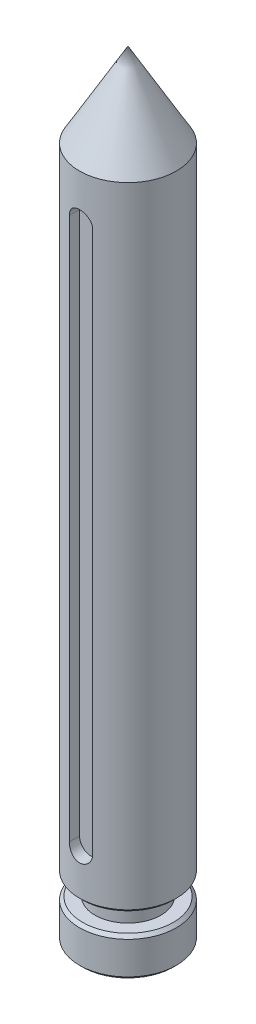
ISO-10303-21;
HEADER;
FILE_DESCRIPTION(('STEP AP214'),'2;1');
FILE_NAME('part.step','',(''),(''),'','','');
FILE_SCHEMA(('AUTOMOTIVE_DESIGN { 1 0 10303 214 1 1 1 1 }'));
ENDSEC;
DATA;
#1=APPLICATION_CONTEXT('core data for automotive mechanical design processes');
#2=APPLICATION_PROTOCOL_DEFINITION('international standard','automotive_design',2000,#1);
#3=PRODUCT_CONTEXT('',#1,'mechanical');
#4=PRODUCT('Part','Part','',(#3));
#5=PRODUCT_RELATED_PRODUCT_CATEGORY('part','',(#4));
#6=PRODUCT_DEFINITION_FORMATION('','',#4);
#7=PRODUCT_DEFINITION_CONTEXT('part definition',#1,'design');
#8=PRODUCT_DEFINITION('design','',#6,#7);
#9=PRODUCT_DEFINITION_SHAPE('','',#8);
#10=(LENGTH_UNIT() NAMED_UNIT(*) SI_UNIT(.MILLI.,.METRE.));
#11=(NAMED_UNIT(*) PLANE_ANGLE_UNIT() SI_UNIT($,.RADIAN.));
#12=(NAMED_UNIT(*) SI_UNIT($,.STERADIAN.) SOLID_ANGLE_UNIT());
#13=UNCERTAINTY_MEASURE_WITH_UNIT(LENGTH_MEASURE(1.E-05),#10,'distance_accuracy_value','');
#14=(GEOMETRIC_REPRESENTATION_CONTEXT(3) GLOBAL_UNCERTAINTY_ASSIGNED_CONTEXT((#13)) GLOBAL_UNIT_ASSIGNED_CONTEXT((#10,
#11,#12)) REPRESENTATION_CONTEXT('',''));
#15=CARTESIAN_POINT('',(0.,0.,0.));
#16=DIRECTION('',(0.,0.,1.));
#17=DIRECTION('',(1.,0.,0.));
#18=AXIS2_PLACEMENT_3D('',#15,#16,#17);
#19=CARTESIAN_POINT('',(0.,200.,0.));
#20=DIRECTION('',(0.,1.,0.));
#21=DIRECTION('',(0.,0.,1.));
#22=AXIS2_PLACEMENT_3D('',#19,#20,#21);
#23=CYLINDRICAL_SURFACE('',#22,12.5);
#24=CARTESIAN_POINT('',(0.,15.8,0.));
#25=DIRECTION('',(0.,-1.,0.));
#26=DIRECTION('',(0.,0.,-1.));
#27=AXIS2_PLACEMENT_3D('',#24,#25,#26);
#28=CIRCLE('',#27,12.5);
#29=CARTESIAN_POINT('',(0.,15.8,-12.5));
#30=VERTEX_POINT('',#29);
#31=EDGE_CURVE('E151',#30,#30,#28,.F.);
#32=ORIENTED_EDGE('',*,*,#31,.T.);
#33=EDGE_LOOP('',(#32));
#34=FACE_BOUND('',#33,.T.);
#35=CARTESIAN_POINT('',(0.,178.3,0.));
#36=DIRECTION('',(0.,1.,0.));
#37=DIRECTION('',(0.,0.,1.));
#38=AXIS2_PLACEMENT_3D('',#35,#36,#37);
#39=CIRCLE('',#38,12.5);
#40=CARTESIAN_POINT('',(0.,178.3,12.5));
#41=VERTEX_POINT('',#40);
#42=EDGE_CURVE('E85',#41,#41,#39,.T.);
#43=ORIENTED_EDGE('',*,*,#42,.F.);
#44=EDGE_LOOP('',(#43));
#45=FACE_BOUND('',#44,.T.);
#46=DIRECTION('',(0.,1.,0.));
#47=VECTOR('',#46,1.);
#48=CARTESIAN_POINT('',(-3.,200.,12.1346610995116));
#49=LINE('',#48,#47);
#50=CARTESIAN_POINT('',(-2.99999999999998,26.7,12.1346610995116));
#51=VERTEX_POINT('',#50);
#52=CARTESIAN_POINT('',(-3.,166.7,12.1346610995116));
#53=VERTEX_POINT('',#52);
#54=EDGE_CURVE('E128',#51,#53,#49,.T.);
#55=ORIENTED_EDGE('',*,*,#54,.T.);
#56=CARTESIAN_POINT('',(-3.,166.7,12.1346610995116));
#57=CARTESIAN_POINT('',(-3.00000949206978,166.783077021776,12.1346522494377));
#58=CARTESIAN_POINT('',(-2.9965492402964,166.866148496063,12.1355140524429));
#59=CARTESIAN_POINT('',(-2.9827629517344,167.031672470762,12.1389133501175));
#60=CARTESIAN_POINT('',(-2.97243800275821,167.114125067153,12.1414505792905));
#61=CARTESIAN_POINT('',(-2.94502172728163,167.277676507974,12.1481288815223));
#62=CARTESIAN_POINT('',(-2.92794313450063,167.358777602422,12.1522669359733));
#63=CARTESIAN_POINT('',(-2.88717657683583,167.519188142462,12.1620165769448));
#64=CARTESIAN_POINT('',(-2.86348853521017,167.598497567238,12.1676281805746));
#65=CARTESIAN_POINT('',(-2.7827647601969,167.83290147684,12.1864398460761));
#66=CARTESIAN_POINT('',(-2.71604288181317,167.984628259207,12.2016236292527));
#67=CARTESIAN_POINT('',(-2.5588284327867,168.274695548726,12.2355556800475));
#68=CARTESIAN_POINT('',(-2.46833033365202,168.413032932298,12.2543047763988));
#69=CARTESIAN_POINT('',(-2.26416625581385,168.675257220063,12.2936784117551));
#70=CARTESIAN_POINT('',(-2.15010988819482,168.798836566434,12.3143307958797));
#71=CARTESIAN_POINT('',(-1.90290471965316,169.02530997184,12.3549430601194));
#72=CARTESIAN_POINT('',(-1.76975289686002,169.128200750693,12.3749028300057));
#73=CARTESIAN_POINT('',(-1.48603085597282,169.311628265713,12.4121880567312));
#74=CARTESIAN_POINT('',(-1.33525974307935,169.391862449511,12.4294765791586));
#75=CARTESIAN_POINT('',(-1.02189537698328,169.525729393292,12.4591517430966));
#76=CARTESIAN_POINT('',(-0.859304329995008,169.579367103018,12.4715392966163));
#77=CARTESIAN_POINT('',(-0.530138997790619,169.657537682363,12.4898199872168));
#78=CARTESIAN_POINT('',(-0.36369627400846,169.682596643798,12.4958303689195));
#79=CARTESIAN_POINT('',(-0.0288643563729841,169.704547596423,12.5010873641785));
#80=CARTESIAN_POINT('',(0.13952461278723,169.701442807296,12.5003347508813));
#81=CARTESIAN_POINT('',(0.469819905954056,169.667536227323,12.4922383469812));
#82=CARTESIAN_POINT('',(0.631788371671672,169.637302663791,12.4850297856931));
#83=CARTESIAN_POINT('',(0.948281253446581,169.550907766057,12.4649878492479));
#84=CARTESIAN_POINT('',(1.10280535537953,169.494745338811,12.4521542369651));
#85=CARTESIAN_POINT('',(1.4015503995901,169.357612340133,12.4220935759201));
#86=CARTESIAN_POINT('',(1.54567254355725,169.276434851904,12.4048300917434));
#87=CARTESIAN_POINT('',(1.81844702027332,169.091733780751,12.3677898661534));
#88=CARTESIAN_POINT('',(1.94709723884516,168.988207149296,12.3480127820244));
#89=CARTESIAN_POINT('',(2.18865245335658,168.758698779981,12.307525839261));
#90=CARTESIAN_POINT('',(2.30108617171468,168.632222521603,12.2868050152656));
#91=CARTESIAN_POINT('',(2.50327463527541,168.361955720219,12.2472145750706));
#92=CARTESIAN_POINT('',(2.59302318632837,168.218160464078,12.2283454653372));
#93=CARTESIAN_POINT('',(2.74756993908988,167.916444778857,12.1945549652827));
#94=CARTESIAN_POINT('',(2.81224875674972,167.758461071121,12.1796525676294));
#95=CARTESIAN_POINT('',(2.91390343638912,167.433515854474,12.1557369076828));
#96=CARTESIAN_POINT('',(2.95092063280088,167.26656814214,12.1467148610394));
#97=CARTESIAN_POINT('',(2.98233825509738,167.031831472668,12.139016121434));
#98=CARTESIAN_POINT('',(2.9889628322337,166.965593061664,12.1373853406504));
#99=CARTESIAN_POINT('',(2.99778858925481,166.832913481029,12.1352084107542));
#100=CARTESIAN_POINT('',(2.99999700022266,166.766472821556,12.1346604885733));
#101=CARTESIAN_POINT('',(3.,166.7,12.1346610995116));
#102=B_SPLINE_CURVE_WITH_KNOTS('',3,(#56,#57,#58,#59,#60,#61,#62,#63,#64,#65,#66,#67,#68,#69,
#70,#71,#72,#73,#74,#75,#76,#77,#78,#79,#80,#81,#82,#83,#84,#85,#86,#87,#88,#89,#90,#91,#92,#93,
#94,#95,#96,#97,#98,#99,#100,#101),.UNSPECIFIED.,.F.,.F.,(4,2,2,2,2,2,2,2,2,2,2,2,2,2,2,2,2,2,2,
2,2,2,4),(0.,0.24914497147599,0.498250471667307,0.746888516046017,0.99552944746449,
1.49234020490804,1.98926658412719,2.49520478005361,3.00122312962131,3.51370966397381,
4.02610078608323,4.52889907799789,5.03163989067205,5.52409016416463,6.01656119905145,
6.51322041190946,7.00994741434777,7.51903074401432,8.02825292829705,8.5398711192154,
9.05072326792556,9.25036600195113,9.44968157003442),.UNSPECIFIED.);
#103=CARTESIAN_POINT('',(3.,166.7,12.1346610995116));
#104=VERTEX_POINT('',#103);
#105=EDGE_CURVE('E82',#53,#104,#102,.T.);
#106=ORIENTED_EDGE('',*,*,#105,.T.);
#107=DIRECTION('',(0.,1.,0.));
#108=VECTOR('',#107,1.);
#109=CARTESIAN_POINT('',(3.,200.,12.1346610995116));
#110=LINE('',#109,#108);
#111=CARTESIAN_POINT('',(3.,26.7,12.1346610995116));
#112=VERTEX_POINT('',#111);
#113=EDGE_CURVE('E116',#104,#112,#110,.F.);
#114=ORIENTED_EDGE('',*,*,#113,.T.);
#115=CARTESIAN_POINT('',(3.00000000000002,26.7,12.1346610995116));
#116=CARTESIAN_POINT('',(3.00000949206981,26.616922978224,12.1346522494377));
#117=CARTESIAN_POINT('',(2.99654924029642,26.5338515039375,12.1355140524429));
#118=CARTESIAN_POINT('',(2.98276295173442,26.3683275292376,12.1389133501175));
#119=CARTESIAN_POINT('',(2.97243800275823,26.2858749328472,12.1414505792905));
#120=CARTESIAN_POINT('',(2.94502172728166,26.1223234920263,12.1481288815222));
#121=CARTESIAN_POINT('',(2.92794313450065,26.0412223975775,12.1522669359732));
#122=CARTESIAN_POINT('',(2.88717657683585,25.8808118575381,12.1620165769448));
#123=CARTESIAN_POINT('',(2.8634885352102,25.8015024327621,12.1676281805746));
#124=CARTESIAN_POINT('',(2.78276476019692,25.5670985231604,12.1864398460761));
#125=CARTESIAN_POINT('',(2.71604288181319,25.4153717407931,12.2016236292527));
#126=CARTESIAN_POINT('',(2.55882843278671,25.1253044512744,12.2355556800475));
#127=CARTESIAN_POINT('',(2.46833033365203,24.9869670677021,12.2543047763988));
#128=CARTESIAN_POINT('',(2.26416625581386,24.7247427799366,12.2936784117551));
#129=CARTESIAN_POINT('',(2.15010988819484,24.6011634335662,12.3143307958797));
#130=CARTESIAN_POINT('',(1.90290471965319,24.3746900281595,12.3549430601194));
#131=CARTESIAN_POINT('',(1.76975289686005,24.2717992493073,12.3749028300056));
#132=CARTESIAN_POINT('',(1.48603085597285,24.0883717342866,12.4121880567312));
#133=CARTESIAN_POINT('',(1.33525974307938,24.0081375504888,12.4294765791586));
#134=CARTESIAN_POINT('',(1.02189537698332,23.8742706067076,12.4591517430966));
#135=CARTESIAN_POINT('',(0.859304329995046,23.8206328969819,12.4715392966163));
#136=CARTESIAN_POINT('',(0.530138997790655,23.7424623176371,12.4898199872168));
#137=CARTESIAN_POINT('',(0.363696274008497,23.7174033562017,12.4958303689195));
#138=CARTESIAN_POINT('',(0.0288643563730217,23.6954524035772,12.5010873641785));
#139=CARTESIAN_POINT('',(-0.139524612787193,23.6985571927045,12.5003347508813));
#140=CARTESIAN_POINT('',(-0.469819905954021,23.7324637726769,12.4922383469812));
#141=CARTESIAN_POINT('',(-0.631788371671638,23.7626973362092,12.4850297856931));
#142=CARTESIAN_POINT('',(-0.948281253446547,23.8490922339427,12.4649878492479));
#143=CARTESIAN_POINT('',(-1.1028053553795,23.9052546611887,12.4521542369651));
#144=CARTESIAN_POINT('',(-1.40155039959007,24.0423876598666,12.4220935759201));
#145=CARTESIAN_POINT('',(-1.54567254355722,24.1235651480961,12.4048300917434));
#146=CARTESIAN_POINT('',(-1.81844702027329,24.3082662192492,12.3677898661535));
#147=CARTESIAN_POINT('',(-1.94709723884513,24.4117928507043,12.3480127820244));
#148=CARTESIAN_POINT('',(-2.18865245335656,24.6413012200194,12.307525839261));
#149=CARTESIAN_POINT('',(-2.30108617171466,24.7677774783973,12.2868050152656));
#150=CARTESIAN_POINT('',(-2.50327463527539,25.0380442797813,12.2472145750706));
#151=CARTESIAN_POINT('',(-2.59302318632834,25.1818395359221,12.2283454653372));
#152=CARTESIAN_POINT('',(-2.74756993908986,25.4835552211431,12.1945549652827));
#153=CARTESIAN_POINT('',(-2.81224875674969,25.6415389288788,12.1796525676294));
#154=CARTESIAN_POINT('',(-2.91390343638909,25.9664841455265,12.1557369076828));
#155=CARTESIAN_POINT('',(-2.95092063280086,26.1334318578605,12.1467148610395));
#156=CARTESIAN_POINT('',(-2.98233825509735,26.3681685273319,12.139016121434));
#157=CARTESIAN_POINT('',(-2.98896283223367,26.4344069383361,12.1373853406504));
#158=CARTESIAN_POINT('',(-2.99778858925478,26.5670865189706,12.1352084107542));
#159=CARTESIAN_POINT('',(-2.99999700022263,26.6335271784439,12.1346604885734));
#160=CARTESIAN_POINT('',(-2.99999999999998,26.7,12.1346610995116));
#161=B_SPLINE_CURVE_WITH_KNOTS('',3,(#115,#116,#117,#118,#119,#120,#121,#122,#123,#124,#125,
#126,#127,#128,#129,#130,#131,#132,#133,#134,#135,#136,#137,#138,#139,#140,#141,#142,#143,#144,
#145,#146,#147,#148,#149,#150,#151,#152,#153,#154,#155,#156,#157,#158,#159,#160),.UNSPECIFIED.,
.F.,.F.,(4,2,2,2,2,2,2,2,2,2,2,2,2,2,2,2,2,2,2,2,2,2,4),(0.,0.24914497147599,0.498250471667293,
0.746888516046027,0.995529447464479,1.49234020490808,1.98926658412721,2.49520478005362,
3.00122312962131,3.51370966397378,4.02610078608322,4.52889907799787,5.03163989067204,
5.52409016416462,6.01656119905144,6.51322041190944,7.00994741434777,7.51903074401432,
8.02825292829705,8.5398711192154,9.05072326792553,9.2503660019511,9.44968157003441),.UNSPECIFIED.);
#162=EDGE_CURVE('E119',#112,#51,#161,.T.);
#163=ORIENTED_EDGE('',*,*,#162,.T.);
#164=EDGE_LOOP('',(#55,#106,#114,#163));
#165=FACE_BOUND('',#164,.T.);
#166=ADVANCED_FACE('F34',(#34,#45,#165),#23,.T.);
#167=CARTESIAN_POINT('',(0.,0.,0.));
#168=DIRECTION('',(0.,-1.,0.));
#169=DIRECTION('',(0.,0.,-1.));
#170=AXIS2_PLACEMENT_3D('',#167,#168,#169);
#171=PLANE('',#170);
#172=CARTESIAN_POINT('',(0.,0.,0.));
#173=DIRECTION('',(0.,-1.,0.));
#174=DIRECTION('',(0.,0.,-1.));
#175=AXIS2_PLACEMENT_3D('',#172,#173,#174);
#176=CIRCLE('',#175,11.6999999999999);
#177=CARTESIAN_POINT('',(0.,0.,-11.6999999999999));
#178=VERTEX_POINT('',#177);
#179=EDGE_CURVE('E11',#178,#178,#176,.T.);
#180=ORIENTED_EDGE('',*,*,#179,.T.);
#181=EDGE_LOOP('',(#180));
#182=FACE_BOUND('',#181,.T.);
#183=ADVANCED_FACE('F194',(#182),#171,.T.);
#184=CARTESIAN_POINT('',(0.,200.,0.));
#185=DIRECTION('',(0.,1.,0.));
#186=DIRECTION('',(0.,0.,1.));
#187=AXIS2_PLACEMENT_3D('',#184,#185,#186);
#188=CYLINDRICAL_SURFACE('',#187,12.5);
#189=CARTESIAN_POINT('',(0.,9.2000000000001,0.));
#190=DIRECTION('',(0.,1.,0.));
#191=DIRECTION('',(0.,0.,1.));
#192=AXIS2_PLACEMENT_3D('',#189,#190,#191);
#193=CIRCLE('',#192,12.5);
#194=CARTESIAN_POINT('',(0.,9.2000000000001,12.5));
#195=VERTEX_POINT('',#194);
#196=EDGE_CURVE('E42',#195,#195,#193,.F.);
#197=ORIENTED_EDGE('',*,*,#196,.T.);
#198=EDGE_LOOP('',(#197));
#199=FACE_BOUND('',#198,.T.);
#200=CARTESIAN_POINT('',(0.,0.800000000000051,0.));
#201=DIRECTION('',(0.,-1.,0.));
#202=DIRECTION('',(0.,0.,-1.));
#203=AXIS2_PLACEMENT_3D('',#200,#201,#202);
#204=CIRCLE('',#203,12.5);
#205=CARTESIAN_POINT('',(0.,0.800000000000051,-12.5));
#206=VERTEX_POINT('',#205);
#207=EDGE_CURVE('E160',#206,#206,#204,.F.);
#208=ORIENTED_EDGE('',*,*,#207,.T.);
#209=EDGE_LOOP('',(#208));
#210=FACE_BOUND('',#209,.T.);
#211=ADVANCED_FACE('F165',(#199,#210),#188,.T.);
#212=CARTESIAN_POINT('',(-12.5,10.,0.));
#213=DIRECTION('',(0.,1.,0.));
#214=DIRECTION('',(0.,0.,1.));
#215=AXIS2_PLACEMENT_3D('',#212,#213,#214);
#216=PLANE('',#215);
#217=CARTESIAN_POINT('',(0.,10.,0.));
#218=DIRECTION('',(0.,1.,0.));
#219=DIRECTION('',(0.,0.,1.));
#220=AXIS2_PLACEMENT_3D('',#217,#218,#219);
#221=CIRCLE('',#220,11.7000000000001);
#222=CARTESIAN_POINT('',(0.,10.,11.7000000000001));
#223=VERTEX_POINT('',#222);
#224=EDGE_CURVE('E157',#223,#223,#221,.T.);
#225=ORIENTED_EDGE('',*,*,#224,.T.);
#226=EDGE_LOOP('',(#225));
#227=FACE_BOUND('',#226,.T.);
#228=CARTESIAN_POINT('',(0.,10.,0.));
#229=DIRECTION('',(0.,1.,0.));
#230=DIRECTION('',(0.,0.,1.));
#231=AXIS2_PLACEMENT_3D('',#228,#229,#230);
#232=CIRCLE('',#231,8.49999999999998);
#233=CARTESIAN_POINT('',(0.,10.,8.49999999999998));
#234=VERTEX_POINT('',#233);
#235=EDGE_CURVE('E113',#234,#234,#232,.T.);
#236=ORIENTED_EDGE('',*,*,#235,.F.);
#237=EDGE_LOOP('',(#236));
#238=FACE_BOUND('',#237,.T.);
#239=ADVANCED_FACE('F174',(#227,#238),#216,.T.);
#240=CARTESIAN_POINT('',(0.,200.,0.));
#241=DIRECTION('',(0.,1.,0.));
#242=DIRECTION('',(0.,0.,1.));
#243=AXIS2_PLACEMENT_3D('',#240,#241,#242);
#244=CYLINDRICAL_SURFACE('',#243,8.49999999999998);
#245=ORIENTED_EDGE('',*,*,#235,.T.);
#246=EDGE_LOOP('',(#245));
#247=FACE_BOUND('',#246,.T.);
#248=CARTESIAN_POINT('',(0.,15.,0.));
#249=DIRECTION('',(0.,1.,0.));
#250=DIRECTION('',(0.,0.,1.));
#251=AXIS2_PLACEMENT_3D('',#248,#249,#250);
#252=CIRCLE('',#251,8.49999999999998);
#253=CARTESIAN_POINT('',(0.,15.,8.49999999999998));
#254=VERTEX_POINT('',#253);
#255=EDGE_CURVE('E110',#254,#254,#252,.T.);
#256=ORIENTED_EDGE('',*,*,#255,.F.);
#257=EDGE_LOOP('',(#256));
#258=FACE_BOUND('',#257,.T.);
#259=ADVANCED_FACE('F177',(#247,#258),#244,.T.);
#260=CARTESIAN_POINT('',(-8.49999999999998,15.,0.));
#261=DIRECTION('',(0.,-1.,0.));
#262=DIRECTION('',(0.,0.,-1.));
#263=AXIS2_PLACEMENT_3D('',#260,#261,#262);
#264=PLANE('',#263);
#265=CARTESIAN_POINT('',(0.,15.,0.));
#266=DIRECTION('',(0.,-1.,0.));
#267=DIRECTION('',(0.,0.,-1.));
#268=AXIS2_PLACEMENT_3D('',#265,#266,#267);
#269=CIRCLE('',#268,11.6999999999999);
#270=CARTESIAN_POINT('',(0.,15.,-11.6999999999999));
#271=VERTEX_POINT('',#270);
#272=EDGE_CURVE('E154',#271,#271,#269,.T.);
#273=ORIENTED_EDGE('',*,*,#272,.T.);
#274=EDGE_LOOP('',(#273));
#275=FACE_BOUND('',#274,.T.);
#276=ORIENTED_EDGE('',*,*,#255,.T.);
#277=EDGE_LOOP('',(#276));
#278=FACE_BOUND('',#277,.T.);
#279=ADVANCED_FACE('F183',(#275,#278),#264,.T.);
#280=CARTESIAN_POINT('',(0.,200.,0.));
#281=DIRECTION('',(0.,-1.,0.));
#282=DIRECTION('',(0.,0.,-1.));
#283=AXIS2_PLACEMENT_3D('',#280,#281,#282);
#284=CONICAL_SURFACE('',#283,0.,0.522613163257077);
#285=ORIENTED_EDGE('',*,*,#42,.T.);
#286=EDGE_LOOP('',(#285));
#287=FACE_BOUND('',#286,.T.);
#288=CARTESIAN_POINT('',(0.,200.,0.));
#289=VERTEX_POINT('',#288);
#290=VERTEX_LOOP('',#289);
#291=FACE_BOUND('',#290,.T.);
#292=ADVANCED_FACE('F145',(#287,#291),#284,.T.);
#293=CARTESIAN_POINT('',(0.,166.7,16.5));
#294=DIRECTION('',(0.,0.,-1.));
#295=DIRECTION('',(-1.,0.,0.));
#296=AXIS2_PLACEMENT_3D('',#293,#294,#295);
#297=CYLINDRICAL_SURFACE('',#296,3.);
#298=DIRECTION('',(0.,0.,-1.));
#299=VECTOR('',#298,1.);
#300=CARTESIAN_POINT('',(-3.,166.7,16.5));
#301=LINE('',#300,#299);
#302=CARTESIAN_POINT('',(-3.,166.7,9.5));
#303=VERTEX_POINT('',#302);
#304=EDGE_CURVE('E75',#53,#303,#301,.T.);
#305=ORIENTED_EDGE('',*,*,#304,.T.);
#306=CARTESIAN_POINT('',(0.,166.7,9.5));
#307=DIRECTION('',(0.,0.,1.));
#308=DIRECTION('',(1.,0.,0.));
#309=AXIS2_PLACEMENT_3D('',#306,#307,#308);
#310=CIRCLE('',#309,3.);
#311=CARTESIAN_POINT('',(3.,166.7,9.5));
#312=VERTEX_POINT('',#311);
#313=EDGE_CURVE('E80',#312,#303,#310,.T.);
#314=ORIENTED_EDGE('',*,*,#313,.F.);
#315=DIRECTION('',(0.,0.,-1.));
#316=VECTOR('',#315,1.);
#317=CARTESIAN_POINT('',(3.,166.7,16.5));
#318=LINE('',#317,#316);
#319=EDGE_CURVE('E104',#104,#312,#318,.T.);
#320=ORIENTED_EDGE('',*,*,#319,.F.);
#321=ORIENTED_EDGE('',*,*,#105,.F.);
#322=EDGE_LOOP('',(#305,#314,#320,#321));
#323=FACE_BOUND('',#322,.T.);
#324=ADVANCED_FACE('F77',(#323),#297,.F.);
#325=CARTESIAN_POINT('',(-3.,166.7,16.5));
#326=DIRECTION('',(1.,0.,0.));
#327=DIRECTION('',(0.,1.,0.));
#328=AXIS2_PLACEMENT_3D('',#325,#326,#327);
#329=PLANE('',#328);
#330=DIRECTION('',(0.,0.,-1.));
#331=VECTOR('',#330,1.);
#332=CARTESIAN_POINT('',(-2.99999999999998,26.7,16.5));
#333=LINE('',#332,#331);
#334=CARTESIAN_POINT('',(-2.99999999999998,26.7,9.5));
#335=VERTEX_POINT('',#334);
#336=EDGE_CURVE('E86',#51,#335,#333,.T.);
#337=ORIENTED_EDGE('',*,*,#336,.T.);
#338=DIRECTION('',(0.,-1.,0.));
#339=VECTOR('',#338,1.);
#340=CARTESIAN_POINT('',(-3.,166.7,9.5));
#341=LINE('',#340,#339);
#342=EDGE_CURVE('E89',#303,#335,#341,.T.);
#343=ORIENTED_EDGE('',*,*,#342,.F.);
#344=ORIENTED_EDGE('',*,*,#304,.F.);
#345=ORIENTED_EDGE('',*,*,#54,.F.);
#346=EDGE_LOOP('',(#337,#343,#344,#345));
#347=FACE_BOUND('',#346,.T.);
#348=ADVANCED_FACE('F90',(#347),#329,.T.);
#349=CARTESIAN_POINT('',(0.,26.7,16.5));
#350=DIRECTION('',(0.,0.,-1.));
#351=DIRECTION('',(-1.,0.,0.));
#352=AXIS2_PLACEMENT_3D('',#349,#350,#351);
#353=CYLINDRICAL_SURFACE('',#352,3.);
#354=DIRECTION('',(0.,0.,-1.));
#355=VECTOR('',#354,1.);
#356=CARTESIAN_POINT('',(3.00000000000002,26.7,16.5));
#357=LINE('',#356,#355);
#358=CARTESIAN_POINT('',(3.00000000000002,26.7,9.5));
#359=VERTEX_POINT('',#358);
#360=EDGE_CURVE('E49',#112,#359,#357,.T.);
#361=ORIENTED_EDGE('',*,*,#360,.T.);
#362=CARTESIAN_POINT('',(0.,26.7,9.5));
#363=DIRECTION('',(0.,0.,1.));
#364=DIRECTION('',(1.,0.,0.));
#365=AXIS2_PLACEMENT_3D('',#362,#363,#364);
#366=CIRCLE('',#365,3.);
#367=EDGE_CURVE('E95',#335,#359,#366,.T.);
#368=ORIENTED_EDGE('',*,*,#367,.F.);
#369=ORIENTED_EDGE('',*,*,#336,.F.);
#370=ORIENTED_EDGE('',*,*,#162,.F.);
#371=EDGE_LOOP('',(#361,#368,#369,#370));
#372=FACE_BOUND('',#371,.T.);
#373=ADVANCED_FACE('F133',(#372),#353,.F.);
#374=CARTESIAN_POINT('',(3.,166.7,16.5));
#375=DIRECTION('',(-1.,0.,0.));
#376=DIRECTION('',(0.,-1.,0.));
#377=AXIS2_PLACEMENT_3D('',#374,#375,#376);
#378=PLANE('',#377);
#379=ORIENTED_EDGE('',*,*,#319,.T.);
#380=DIRECTION('',(0.,1.,0.));
#381=VECTOR('',#380,1.);
#382=CARTESIAN_POINT('',(3.,166.7,9.5));
#383=LINE('',#382,#381);
#384=EDGE_CURVE('E99',#359,#312,#383,.T.);
#385=ORIENTED_EDGE('',*,*,#384,.F.);
#386=ORIENTED_EDGE('',*,*,#360,.F.);
#387=ORIENTED_EDGE('',*,*,#113,.F.);
#388=EDGE_LOOP('',(#379,#385,#386,#387));
#389=FACE_BOUND('',#388,.T.);
#390=ADVANCED_FACE('F138',(#389),#378,.T.);
#391=CARTESIAN_POINT('',(0.,166.7,9.5));
#392=DIRECTION('',(0.,0.,1.));
#393=DIRECTION('',(1.,0.,0.));
#394=AXIS2_PLACEMENT_3D('',#391,#392,#393);
#395=PLANE('',#394);
#396=ORIENTED_EDGE('',*,*,#313,.T.);
#397=ORIENTED_EDGE('',*,*,#342,.T.);
#398=ORIENTED_EDGE('',*,*,#367,.T.);
#399=ORIENTED_EDGE('',*,*,#384,.T.);
#400=EDGE_LOOP('',(#396,#397,#398,#399));
#401=FACE_BOUND('',#400,.T.);
#402=ADVANCED_FACE('F98',(#401),#395,.T.);
#403=CARTESIAN_POINT('',(0.,15.8,0.));
#404=DIRECTION('',(0.,1.,0.));
#405=DIRECTION('',(0.,0.,1.));
#406=AXIS2_PLACEMENT_3D('',#403,#404,#405);
#407=CONICAL_SURFACE('',#406,12.5,0.78539816339746);
#408=ORIENTED_EDGE('',*,*,#272,.F.);
#409=EDGE_LOOP('',(#408));
#410=FACE_BOUND('',#409,.T.);
#411=ORIENTED_EDGE('',*,*,#31,.F.);
#412=EDGE_LOOP('',(#411));
#413=FACE_BOUND('',#412,.T.);
#414=ADVANCED_FACE('F171',(#410,#413),#407,.T.);
#415=CARTESIAN_POINT('',(0.,10.,0.));
#416=DIRECTION('',(0.,-1.,0.));
#417=DIRECTION('',(0.,0.,-1.));
#418=AXIS2_PLACEMENT_3D('',#415,#416,#417);
#419=CONICAL_SURFACE('',#418,11.7000000000001,0.785398163397442);
#420=ORIENTED_EDGE('',*,*,#196,.F.);
#421=EDGE_LOOP('',(#420));
#422=FACE_BOUND('',#421,.T.);
#423=ORIENTED_EDGE('',*,*,#224,.F.);
#424=EDGE_LOOP('',(#423));
#425=FACE_BOUND('',#424,.T.);
#426=ADVANCED_FACE('F168',(#422,#425),#419,.T.);
#427=CARTESIAN_POINT('',(0.,0.800000000000051,0.));
#428=DIRECTION('',(0.,1.,0.));
#429=DIRECTION('',(0.,0.,1.));
#430=AXIS2_PLACEMENT_3D('',#427,#428,#429);
#431=CONICAL_SURFACE('',#430,12.5,0.785398163397459);
#432=ORIENTED_EDGE('',*,*,#179,.F.);
#433=EDGE_LOOP('',(#432));
#434=FACE_BOUND('',#433,.T.);
#435=ORIENTED_EDGE('',*,*,#207,.F.);
#436=EDGE_LOOP('',(#435));
#437=FACE_BOUND('',#436,.T.);
#438=ADVANCED_FACE('F36',(#434,#437),#431,.T.);
#439=CLOSED_SHELL('',(#166,#183,#211,#239,#259,#279,#292,#324,#348,#373,#390,#402,#414,#426,#438));
#440=MANIFOLD_SOLID_BREP('B2',#439);
#441=ADVANCED_BREP_SHAPE_REPRESENTATION('',(#18,#440),#14);
#442=SHAPE_DEFINITION_REPRESENTATION(#9,#441);
ENDSEC;
END-ISO-10303-21;
